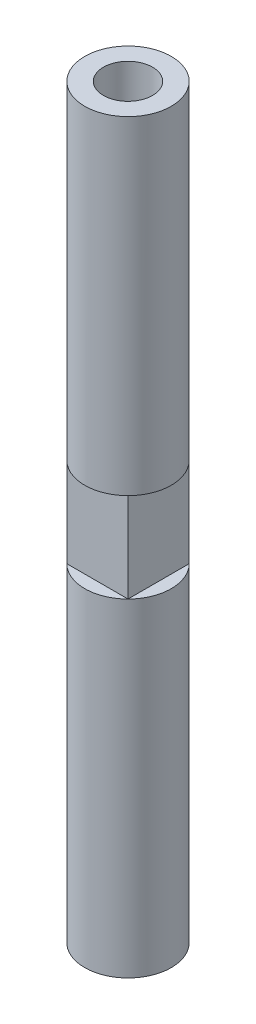
ISO-10303-21;
HEADER;
FILE_DESCRIPTION(('STEP AP214'),'2;1');
FILE_NAME('part.step','',(''),(''),'','','');
FILE_SCHEMA(('AUTOMOTIVE_DESIGN { 1 0 10303 214 1 1 1 1 }'));
ENDSEC;
DATA;
#1=APPLICATION_CONTEXT('core data for automotive mechanical design processes');
#2=APPLICATION_PROTOCOL_DEFINITION('international standard','automotive_design',2000,#1);
#3=PRODUCT_CONTEXT('',#1,'mechanical');
#4=PRODUCT('Part','Part','',(#3));
#5=PRODUCT_RELATED_PRODUCT_CATEGORY('part','',(#4));
#6=PRODUCT_DEFINITION_FORMATION('','',#4);
#7=PRODUCT_DEFINITION_CONTEXT('part definition',#1,'design');
#8=PRODUCT_DEFINITION('design','',#6,#7);
#9=PRODUCT_DEFINITION_SHAPE('','',#8);
#10=(LENGTH_UNIT() NAMED_UNIT(*) SI_UNIT(.MILLI.,.METRE.));
#11=(NAMED_UNIT(*) PLANE_ANGLE_UNIT() SI_UNIT($,.RADIAN.));
#12=(NAMED_UNIT(*) SI_UNIT($,.STERADIAN.) SOLID_ANGLE_UNIT());
#13=UNCERTAINTY_MEASURE_WITH_UNIT(LENGTH_MEASURE(1.E-05),#10,'distance_accuracy_value','');
#14=(GEOMETRIC_REPRESENTATION_CONTEXT(3) GLOBAL_UNCERTAINTY_ASSIGNED_CONTEXT((#13)) GLOBAL_UNIT_ASSIGNED_CONTEXT((#10,
#11,#12)) REPRESENTATION_CONTEXT('',''));
#15=CARTESIAN_POINT('',(0.,0.,0.));
#16=DIRECTION('',(0.,0.,1.));
#17=DIRECTION('',(1.,0.,0.));
#18=AXIS2_PLACEMENT_3D('',#15,#16,#17);
#19=CARTESIAN_POINT('',(0.,63.5,0.));
#20=DIRECTION('',(0.,-1.,0.));
#21=DIRECTION('',(0.,0.,-1.));
#22=AXIS2_PLACEMENT_3D('',#19,#20,#21);
#23=CYLINDRICAL_SURFACE('',#22,3.683);
#24=CARTESIAN_POINT('',(0.,63.5,0.));
#25=DIRECTION('',(0.,1.,0.));
#26=DIRECTION('',(0.,0.,1.));
#27=AXIS2_PLACEMENT_3D('',#24,#25,#26);
#28=CIRCLE('',#27,3.683);
#29=CARTESIAN_POINT('',(0.,63.5,3.683));
#30=VERTEX_POINT('',#29);
#31=EDGE_CURVE('E120',#30,#30,#28,.T.);
#32=ORIENTED_EDGE('',*,*,#31,.F.);
#33=EDGE_LOOP('',(#32));
#34=FACE_BOUND('',#33,.T.);
#35=CARTESIAN_POINT('',(0.,35.56,0.));
#36=DIRECTION('',(0.,-1.,0.));
#37=DIRECTION('',(0.,0.,-1.));
#38=AXIS2_PLACEMENT_3D('',#35,#36,#37);
#39=CIRCLE('',#38,3.683);
#40=CARTESIAN_POINT('',(-2.60427427511005,35.56,2.60427427511005));
#41=VERTEX_POINT('',#40);
#42=CARTESIAN_POINT('',(-2.60427427511005,35.56,-2.60427427511005));
#43=VERTEX_POINT('',#42);
#44=EDGE_CURVE('E12',#41,#43,#39,.T.);
#45=ORIENTED_EDGE('',*,*,#44,.F.);
#46=CARTESIAN_POINT('',(2.60427427511005,35.56,2.60427427511005));
#47=VERTEX_POINT('',#46);
#48=EDGE_CURVE('E42',#47,#41,#39,.T.);
#49=ORIENTED_EDGE('',*,*,#48,.F.);
#50=CARTESIAN_POINT('',(2.60427427511005,35.56,-2.60427427511005));
#51=VERTEX_POINT('',#50);
#52=EDGE_CURVE('E79',#51,#47,#39,.T.);
#53=ORIENTED_EDGE('',*,*,#52,.F.);
#54=EDGE_CURVE('E36',#43,#51,#39,.T.);
#55=ORIENTED_EDGE('',*,*,#54,.F.);
#56=EDGE_LOOP('',(#45,#49,#53,#55));
#57=FACE_BOUND('',#56,.T.);
#58=ADVANCED_FACE('F33',(#34,#57),#23,.T.);
#59=CARTESIAN_POINT('',(0.,63.5,0.));
#60=DIRECTION('',(0.,1.,0.));
#61=DIRECTION('',(0.,0.,1.));
#62=AXIS2_PLACEMENT_3D('',#59,#60,#61);
#63=PLANE('',#62);
#64=CARTESIAN_POINT('',(0.,63.5,0.));
#65=DIRECTION('',(0.,-1.,0.));
#66=DIRECTION('',(0.,0.,-1.));
#67=AXIS2_PLACEMENT_3D('',#64,#65,#66);
#68=CIRCLE('',#67,2.09);
#69=CARTESIAN_POINT('',(0.,63.5,-2.09));
#70=VERTEX_POINT('',#69);
#71=EDGE_CURVE('E135',#70,#70,#68,.T.);
#72=ORIENTED_EDGE('',*,*,#71,.T.);
#73=EDGE_LOOP('',(#72));
#74=FACE_BOUND('',#73,.T.);
#75=ORIENTED_EDGE('',*,*,#31,.T.);
#76=EDGE_LOOP('',(#75));
#77=FACE_BOUND('',#76,.T.);
#78=ADVANCED_FACE('F174',(#74,#77),#63,.T.);
#79=CARTESIAN_POINT('',(0.,43.18,0.));
#80=DIRECTION('',(0.,1.,0.));
#81=DIRECTION('',(0.,0.,1.));
#82=AXIS2_PLACEMENT_3D('',#79,#80,#81);
#83=CYLINDRICAL_SURFACE('',#82,2.09);
#84=CARTESIAN_POINT('',(0.,43.18,0.));
#85=DIRECTION('',(0.,-1.,0.));
#86=DIRECTION('',(0.,0.,-1.));
#87=AXIS2_PLACEMENT_3D('',#84,#85,#86);
#88=CIRCLE('',#87,2.09);
#89=CARTESIAN_POINT('',(0.,43.18,-2.09));
#90=VERTEX_POINT('',#89);
#91=EDGE_CURVE('E132',#90,#90,#88,.T.);
#92=ORIENTED_EDGE('',*,*,#91,.T.);
#93=EDGE_LOOP('',(#92));
#94=FACE_BOUND('',#93,.T.);
#95=ORIENTED_EDGE('',*,*,#71,.F.);
#96=EDGE_LOOP('',(#95));
#97=FACE_BOUND('',#96,.T.);
#98=ADVANCED_FACE('F180',(#94,#97),#83,.F.);
#99=CARTESIAN_POINT('',(0.,43.18,0.));
#100=DIRECTION('',(0.,1.,0.));
#101=DIRECTION('',(0.,0.,-1.));
#102=AXIS2_PLACEMENT_3D('',#99,#100,#101);
#103=PLANE('',#102);
#104=ORIENTED_EDGE('',*,*,#91,.F.);
#105=EDGE_LOOP('',(#104));
#106=FACE_BOUND('',#105,.T.);
#107=ADVANCED_FACE('F172',(#106),#103,.T.);
#108=CARTESIAN_POINT('',(0.,35.56,0.));
#109=DIRECTION('',(0.,-1.,0.));
#110=DIRECTION('',(0.,0.,-1.));
#111=AXIS2_PLACEMENT_3D('',#108,#109,#110);
#112=PLANE('',#111);
#113=ORIENTED_EDGE('',*,*,#52,.T.);
#114=DIRECTION('',(0.,0.,1.));
#115=VECTOR('',#114,1.);
#116=CARTESIAN_POINT('',(2.60427427511005,35.56,2.60427427511005));
#117=LINE('',#116,#115);
#118=EDGE_CURVE('E83',#51,#47,#117,.T.);
#119=ORIENTED_EDGE('',*,*,#118,.F.);
#120=EDGE_LOOP('',(#113,#119));
#121=FACE_BOUND('',#120,.T.);
#122=ADVANCED_FACE('F81',(#121),#112,.T.);
#123=ORIENTED_EDGE('',*,*,#48,.T.);
#124=DIRECTION('',(-1.,0.,0.));
#125=VECTOR('',#124,1.);
#126=CARTESIAN_POINT('',(2.60427427511005,35.56,2.60427427511005));
#127=LINE('',#126,#125);
#128=EDGE_CURVE('E95',#47,#41,#127,.T.);
#129=ORIENTED_EDGE('',*,*,#128,.F.);
#130=EDGE_LOOP('',(#123,#129));
#131=FACE_BOUND('',#130,.T.);
#132=ADVANCED_FACE('F104',(#131),#112,.T.);
#133=ORIENTED_EDGE('',*,*,#44,.T.);
#134=DIRECTION('',(0.,0.,-1.));
#135=VECTOR('',#134,1.);
#136=CARTESIAN_POINT('',(-2.60427427511005,35.56,2.60427427511005));
#137=LINE('',#136,#135);
#138=EDGE_CURVE('E57',#41,#43,#137,.T.);
#139=ORIENTED_EDGE('',*,*,#138,.F.);
#140=EDGE_LOOP('',(#133,#139));
#141=FACE_BOUND('',#140,.T.);
#142=ADVANCED_FACE('F159',(#141),#112,.T.);
#143=ORIENTED_EDGE('',*,*,#54,.T.);
#144=DIRECTION('',(1.,0.,0.));
#145=VECTOR('',#144,1.);
#146=CARTESIAN_POINT('',(2.60427427511005,35.56,-2.60427427511005));
#147=LINE('',#146,#145);
#148=EDGE_CURVE('E110',#43,#51,#147,.T.);
#149=ORIENTED_EDGE('',*,*,#148,.F.);
#150=EDGE_LOOP('',(#143,#149));
#151=FACE_BOUND('',#150,.T.);
#152=ADVANCED_FACE('F156',(#151),#112,.T.);
#153=CARTESIAN_POINT('',(0.,27.94,0.));
#154=DIRECTION('',(0.,-1.,0.));
#155=DIRECTION('',(0.,0.,-1.));
#156=AXIS2_PLACEMENT_3D('',#153,#154,#155);
#157=PLANE('',#156);
#158=DIRECTION('',(0.,0.,1.));
#159=VECTOR('',#158,1.);
#160=CARTESIAN_POINT('',(2.60427427511005,27.94,2.60427427511005));
#161=LINE('',#160,#159);
#162=CARTESIAN_POINT('',(2.60427427511005,27.94,-2.60427427511005));
#163=VERTEX_POINT('',#162);
#164=CARTESIAN_POINT('',(2.60427427511005,27.94,2.60427427511005));
#165=VERTEX_POINT('',#164);
#166=EDGE_CURVE('E49',#163,#165,#161,.T.);
#167=ORIENTED_EDGE('',*,*,#166,.T.);
#168=CARTESIAN_POINT('',(0.,27.94,0.));
#169=DIRECTION('',(0.,-1.,0.));
#170=DIRECTION('',(0.,0.,-1.));
#171=AXIS2_PLACEMENT_3D('',#168,#169,#170);
#172=CIRCLE('',#171,3.683);
#173=EDGE_CURVE('E115',#163,#165,#172,.T.);
#174=ORIENTED_EDGE('',*,*,#173,.F.);
#175=EDGE_LOOP('',(#167,#174));
#176=FACE_BOUND('',#175,.T.);
#177=ADVANCED_FACE('F158',(#176),#157,.F.);
#178=DIRECTION('',(-1.,0.,0.));
#179=VECTOR('',#178,1.);
#180=CARTESIAN_POINT('',(2.60427427511005,27.94,2.60427427511005));
#181=LINE('',#180,#179);
#182=CARTESIAN_POINT('',(-2.60427427511005,27.94,2.60427427511005));
#183=VERTEX_POINT('',#182);
#184=EDGE_CURVE('E98',#165,#183,#181,.T.);
#185=ORIENTED_EDGE('',*,*,#184,.T.);
#186=EDGE_CURVE('E87',#165,#183,#172,.T.);
#187=ORIENTED_EDGE('',*,*,#186,.F.);
#188=EDGE_LOOP('',(#185,#187));
#189=FACE_BOUND('',#188,.T.);
#190=ADVANCED_FACE('F165',(#189),#157,.F.);
#191=DIRECTION('',(0.,0.,-1.));
#192=VECTOR('',#191,1.);
#193=CARTESIAN_POINT('',(-2.60427427511005,27.94,2.60427427511005));
#194=LINE('',#193,#192);
#195=CARTESIAN_POINT('',(-2.60427427511005,27.94,-2.60427427511005));
#196=VERTEX_POINT('',#195);
#197=EDGE_CURVE('E147',#183,#196,#194,.T.);
#198=ORIENTED_EDGE('',*,*,#197,.T.);
#199=EDGE_CURVE('E41',#183,#196,#172,.T.);
#200=ORIENTED_EDGE('',*,*,#199,.F.);
#201=EDGE_LOOP('',(#198,#200));
#202=FACE_BOUND('',#201,.T.);
#203=ADVANCED_FACE('F248',(#202),#157,.F.);
#204=DIRECTION('',(1.,0.,0.));
#205=VECTOR('',#204,1.);
#206=CARTESIAN_POINT('',(2.60427427511005,27.94,-2.60427427511005));
#207=LINE('',#206,#205);
#208=EDGE_CURVE('E145',#196,#163,#207,.T.);
#209=ORIENTED_EDGE('',*,*,#208,.T.);
#210=EDGE_CURVE('E113',#196,#163,#172,.T.);
#211=ORIENTED_EDGE('',*,*,#210,.F.);
#212=EDGE_LOOP('',(#209,#211));
#213=FACE_BOUND('',#212,.T.);
#214=ADVANCED_FACE('F168',(#213),#157,.F.);
#215=CARTESIAN_POINT('',(-2.60427427511005,35.56,2.60427427511005));
#216=DIRECTION('',(-1.,0.,0.));
#217=DIRECTION('',(0.,0.,1.));
#218=AXIS2_PLACEMENT_3D('',#215,#216,#217);
#219=PLANE('',#218);
#220=ORIENTED_EDGE('',*,*,#197,.F.);
#221=DIRECTION('',(0.,-1.,0.));
#222=VECTOR('',#221,1.);
#223=CARTESIAN_POINT('',(-2.60427427511005,35.56,2.60427427511005));
#224=LINE('',#223,#222);
#225=EDGE_CURVE('E100',#41,#183,#224,.T.);
#226=ORIENTED_EDGE('',*,*,#225,.F.);
#227=ORIENTED_EDGE('',*,*,#138,.T.);
#228=DIRECTION('',(0.,-1.,0.));
#229=VECTOR('',#228,1.);
#230=CARTESIAN_POINT('',(-2.60427427511005,35.56,-2.60427427511005));
#231=LINE('',#230,#229);
#232=EDGE_CURVE('E105',#43,#196,#231,.T.);
#233=ORIENTED_EDGE('',*,*,#232,.T.);
#234=EDGE_LOOP('',(#220,#226,#227,#233));
#235=FACE_BOUND('',#234,.T.);
#236=ADVANCED_FACE('F265',(#235),#219,.T.);
#237=CARTESIAN_POINT('',(2.60427427511005,35.56,2.60427427511005));
#238=DIRECTION('',(0.,0.,1.));
#239=DIRECTION('',(1.,0.,0.));
#240=AXIS2_PLACEMENT_3D('',#237,#238,#239);
#241=PLANE('',#240);
#242=ORIENTED_EDGE('',*,*,#184,.F.);
#243=DIRECTION('',(0.,-1.,0.));
#244=VECTOR('',#243,1.);
#245=CARTESIAN_POINT('',(2.60427427511005,35.56,2.60427427511005));
#246=LINE('',#245,#244);
#247=EDGE_CURVE('E91',#47,#165,#246,.T.);
#248=ORIENTED_EDGE('',*,*,#247,.F.);
#249=ORIENTED_EDGE('',*,*,#128,.T.);
#250=ORIENTED_EDGE('',*,*,#225,.T.);
#251=EDGE_LOOP('',(#242,#248,#249,#250));
#252=FACE_BOUND('',#251,.T.);
#253=ADVANCED_FACE('F93',(#252),#241,.T.);
#254=CARTESIAN_POINT('',(2.60427427511005,35.56,2.60427427511005));
#255=DIRECTION('',(1.,0.,0.));
#256=DIRECTION('',(0.,0.,-1.));
#257=AXIS2_PLACEMENT_3D('',#254,#255,#256);
#258=PLANE('',#257);
#259=ORIENTED_EDGE('',*,*,#166,.F.);
#260=DIRECTION('',(0.,-1.,0.));
#261=VECTOR('',#260,1.);
#262=CARTESIAN_POINT('',(2.60427427511005,35.56,-2.60427427511005));
#263=LINE('',#262,#261);
#264=EDGE_CURVE('E101',#51,#163,#263,.T.);
#265=ORIENTED_EDGE('',*,*,#264,.F.);
#266=ORIENTED_EDGE('',*,*,#118,.T.);
#267=ORIENTED_EDGE('',*,*,#247,.T.);
#268=EDGE_LOOP('',(#259,#265,#266,#267));
#269=FACE_BOUND('',#268,.T.);
#270=ADVANCED_FACE('F107',(#269),#258,.T.);
#271=CARTESIAN_POINT('',(2.60427427511005,35.56,-2.60427427511005));
#272=DIRECTION('',(0.,0.,-1.));
#273=DIRECTION('',(-1.,0.,0.));
#274=AXIS2_PLACEMENT_3D('',#271,#272,#273);
#275=PLANE('',#274);
#276=ORIENTED_EDGE('',*,*,#208,.F.);
#277=ORIENTED_EDGE('',*,*,#232,.F.);
#278=ORIENTED_EDGE('',*,*,#148,.T.);
#279=ORIENTED_EDGE('',*,*,#264,.T.);
#280=EDGE_LOOP('',(#276,#277,#278,#279));
#281=FACE_BOUND('',#280,.T.);
#282=ADVANCED_FACE('F154',(#281),#275,.T.);
#283=CARTESIAN_POINT('',(0.,20.32,0.));
#284=DIRECTION('',(0.,-1.,0.));
#285=DIRECTION('',(0.,0.,-1.));
#286=AXIS2_PLACEMENT_3D('',#283,#284,#285);
#287=PLANE('',#286);
#288=CARTESIAN_POINT('',(0.,20.32,0.));
#289=DIRECTION('',(0.,-1.,0.));
#290=DIRECTION('',(0.,0.,-1.));
#291=AXIS2_PLACEMENT_3D('',#288,#289,#290);
#292=CIRCLE('',#291,2.09);
#293=CARTESIAN_POINT('',(0.,20.32,-2.09));
#294=VERTEX_POINT('',#293);
#295=EDGE_CURVE('E127',#294,#294,#292,.T.);
#296=ORIENTED_EDGE('',*,*,#295,.T.);
#297=EDGE_LOOP('',(#296));
#298=FACE_BOUND('',#297,.T.);
#299=ADVANCED_FACE('F196',(#298),#287,.T.);
#300=CARTESIAN_POINT('',(0.,20.32,0.));
#301=DIRECTION('',(0.,-1.,0.));
#302=DIRECTION('',(0.,0.,-1.));
#303=AXIS2_PLACEMENT_3D('',#300,#301,#302);
#304=CYLINDRICAL_SURFACE('',#303,2.09);
#305=ORIENTED_EDGE('',*,*,#295,.F.);
#306=EDGE_LOOP('',(#305));
#307=FACE_BOUND('',#306,.T.);
#308=CARTESIAN_POINT('',(0.,0.,0.));
#309=DIRECTION('',(0.,-1.,0.));
#310=DIRECTION('',(0.,0.,-1.));
#311=AXIS2_PLACEMENT_3D('',#308,#309,#310);
#312=CIRCLE('',#311,2.09);
#313=CARTESIAN_POINT('',(0.,0.,-2.09));
#314=VERTEX_POINT('',#313);
#315=EDGE_CURVE('E129',#314,#314,#312,.T.);
#316=ORIENTED_EDGE('',*,*,#315,.T.);
#317=EDGE_LOOP('',(#316));
#318=FACE_BOUND('',#317,.T.);
#319=ADVANCED_FACE('F189',(#307,#318),#304,.F.);
#320=CARTESIAN_POINT('',(0.,0.,0.));
#321=DIRECTION('',(0.,1.,0.));
#322=DIRECTION('',(0.,0.,1.));
#323=AXIS2_PLACEMENT_3D('',#320,#321,#322);
#324=PLANE('',#323);
#325=ORIENTED_EDGE('',*,*,#315,.F.);
#326=EDGE_LOOP('',(#325));
#327=FACE_BOUND('',#326,.T.);
#328=CARTESIAN_POINT('',(0.,0.,0.));
#329=DIRECTION('',(0.,1.,0.));
#330=DIRECTION('',(0.,0.,1.));
#331=AXIS2_PLACEMENT_3D('',#328,#329,#330);
#332=CIRCLE('',#331,3.683);
#333=CARTESIAN_POINT('',(0.,0.,3.683));
#334=VERTEX_POINT('',#333);
#335=EDGE_CURVE('E122',#334,#334,#332,.T.);
#336=ORIENTED_EDGE('',*,*,#335,.F.);
#337=EDGE_LOOP('',(#336));
#338=FACE_BOUND('',#337,.T.);
#339=ADVANCED_FACE('F184',(#327,#338),#324,.F.);
#340=ORIENTED_EDGE('',*,*,#335,.T.);
#341=EDGE_LOOP('',(#340));
#342=FACE_BOUND('',#341,.T.);
#343=ORIENTED_EDGE('',*,*,#186,.T.);
#344=ORIENTED_EDGE('',*,*,#199,.T.);
#345=ORIENTED_EDGE('',*,*,#210,.T.);
#346=ORIENTED_EDGE('',*,*,#173,.T.);
#347=EDGE_LOOP('',(#343,#344,#345,#346));
#348=FACE_BOUND('',#347,.T.);
#349=ADVANCED_FACE('F176',(#342,#348),#23,.T.);
#350=CLOSED_SHELL('',(#58,#78,#98,#107,#122,#132,#142,#152,#177,#190,#203,#214,#236,#253,#270,
#282,#299,#319,#339,#349));
#351=MANIFOLD_SOLID_BREP('B2',#350);
#352=ADVANCED_BREP_SHAPE_REPRESENTATION('',(#18,#351),#14);
#353=SHAPE_DEFINITION_REPRESENTATION(#9,#352);
ENDSEC;
END-ISO-10303-21;
